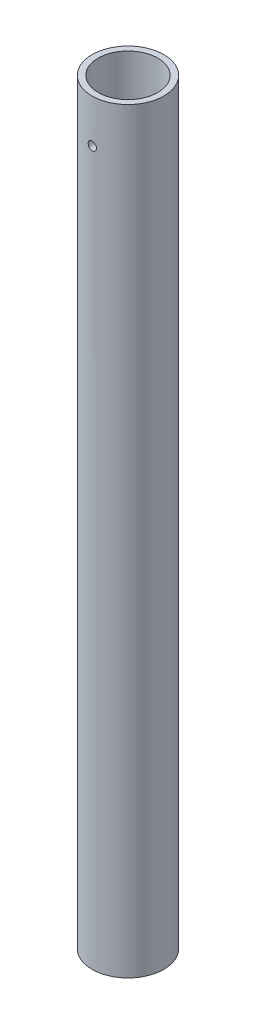
ISO-10303-21;
HEADER;
FILE_DESCRIPTION(('STEP AP214'),'2;1');
FILE_NAME('part.step','',(''),(''),'','','');
FILE_SCHEMA(('AUTOMOTIVE_DESIGN { 1 0 10303 214 1 1 1 1 }'));
ENDSEC;
DATA;
#1=APPLICATION_CONTEXT('core data for automotive mechanical design processes');
#2=APPLICATION_PROTOCOL_DEFINITION('international standard','automotive_design',2000,#1);
#3=PRODUCT_CONTEXT('',#1,'mechanical');
#4=PRODUCT('Part','Part','',(#3));
#5=PRODUCT_RELATED_PRODUCT_CATEGORY('part','',(#4));
#6=PRODUCT_DEFINITION_FORMATION('','',#4);
#7=PRODUCT_DEFINITION_CONTEXT('part definition',#1,'design');
#8=PRODUCT_DEFINITION('design','',#6,#7);
#9=PRODUCT_DEFINITION_SHAPE('','',#8);
#10=(LENGTH_UNIT() NAMED_UNIT(*) SI_UNIT(.MILLI.,.METRE.));
#11=(NAMED_UNIT(*) PLANE_ANGLE_UNIT() SI_UNIT($,.RADIAN.));
#12=(NAMED_UNIT(*) SI_UNIT($,.STERADIAN.) SOLID_ANGLE_UNIT());
#13=UNCERTAINTY_MEASURE_WITH_UNIT(LENGTH_MEASURE(1.E-05),#10,'distance_accuracy_value','');
#14=(GEOMETRIC_REPRESENTATION_CONTEXT(3) GLOBAL_UNCERTAINTY_ASSIGNED_CONTEXT((#13)) GLOBAL_UNIT_ASSIGNED_CONTEXT((#10,
#11,#12)) REPRESENTATION_CONTEXT('',''));
#15=CARTESIAN_POINT('',(0.,0.,0.));
#16=DIRECTION('',(0.,0.,1.));
#17=DIRECTION('',(1.,0.,0.));
#18=AXIS2_PLACEMENT_3D('',#15,#16,#17);
#19=CARTESIAN_POINT('',(0.,444.5,0.));
#20=DIRECTION('',(0.,1.,0.));
#21=DIRECTION('',(0.,0.,1.));
#22=AXIS2_PLACEMENT_3D('',#19,#20,#21);
#23=PLANE('',#22);
#24=CARTESIAN_POINT('',(0.,444.5,0.));
#25=DIRECTION('',(0.,1.,0.));
#26=DIRECTION('',(0.,0.,1.));
#27=AXIS2_PLACEMENT_3D('',#24,#25,#26);
#28=CIRCLE('',#27,21.082);
#29=CARTESIAN_POINT('',(0.,444.5,21.082));
#30=VERTEX_POINT('',#29);
#31=EDGE_CURVE('E46',#30,#30,#28,.T.);
#32=ORIENTED_EDGE('',*,*,#31,.T.);
#33=EDGE_LOOP('',(#32));
#34=FACE_BOUND('',#33,.T.);
#35=CARTESIAN_POINT('',(0.,444.5,0.));
#36=DIRECTION('',(0.,1.,0.));
#37=DIRECTION('',(0.,0.,1.));
#38=AXIS2_PLACEMENT_3D('',#35,#36,#37);
#39=CIRCLE('',#38,17.526);
#40=CARTESIAN_POINT('',(0.,444.5,17.526));
#41=VERTEX_POINT('',#40);
#42=EDGE_CURVE('E82',#41,#41,#39,.T.);
#43=ORIENTED_EDGE('',*,*,#42,.F.);
#44=EDGE_LOOP('',(#43));
#45=FACE_BOUND('',#44,.T.);
#46=ADVANCED_FACE('F30',(#34,#45),#23,.T.);
#47=CARTESIAN_POINT('',(0.,0.,0.));
#48=DIRECTION('',(0.,1.,0.));
#49=DIRECTION('',(0.,0.,1.));
#50=AXIS2_PLACEMENT_3D('',#47,#48,#49);
#51=PLANE('',#50);
#52=CARTESIAN_POINT('',(0.,0.,0.));
#53=DIRECTION('',(0.,1.,0.));
#54=DIRECTION('',(0.,0.,1.));
#55=AXIS2_PLACEMENT_3D('',#52,#53,#54);
#56=CIRCLE('',#55,21.082);
#57=CARTESIAN_POINT('',(0.,0.,21.082));
#58=VERTEX_POINT('',#57);
#59=EDGE_CURVE('E50',#58,#58,#56,.T.);
#60=ORIENTED_EDGE('',*,*,#59,.F.);
#61=EDGE_LOOP('',(#60));
#62=FACE_BOUND('',#61,.T.);
#63=CARTESIAN_POINT('',(0.,0.,0.));
#64=DIRECTION('',(0.,1.,0.));
#65=DIRECTION('',(0.,0.,1.));
#66=AXIS2_PLACEMENT_3D('',#63,#64,#65);
#67=CIRCLE('',#66,17.526);
#68=CARTESIAN_POINT('',(0.,0.,17.526));
#69=VERTEX_POINT('',#68);
#70=EDGE_CURVE('E81',#69,#69,#67,.T.);
#71=ORIENTED_EDGE('',*,*,#70,.T.);
#72=EDGE_LOOP('',(#71));
#73=FACE_BOUND('',#72,.T.);
#74=ADVANCED_FACE('F88',(#62,#73),#51,.F.);
#75=CARTESIAN_POINT('',(0.,444.5,0.));
#76=DIRECTION('',(0.,-1.,0.));
#77=DIRECTION('',(0.,0.,-1.));
#78=AXIS2_PLACEMENT_3D('',#75,#76,#77);
#79=CYLINDRICAL_SURFACE('',#78,21.082);
#80=CARTESIAN_POINT('',(0.,421.55745,-21.082));
#81=CARTESIAN_POINT('',(-0.137535587151131,421.557444113368,-21.0819981896699));
#82=CARTESIAN_POINT('',(-0.275158927091594,421.545864951829,-21.0806398639898));
#83=CARTESIAN_POINT('',(-0.546581132900881,421.499853296938,-21.0753518736465));
#84=CARTESIAN_POINT('',(-0.680375767190936,421.465396464516,-21.0714194705398));
#85=CARTESIAN_POINT('',(-0.940171479974304,421.374654035912,-21.0614266548056));
#86=CARTESIAN_POINT('',(-1.06617754902381,421.318382589229,-21.0553676218034));
#87=CARTESIAN_POINT('',(-1.30693195036864,421.185638009358,-21.0417967399056));
#88=CARTESIAN_POINT('',(-1.42168231936252,421.109168540248,-21.0342851545803));
#89=CARTESIAN_POINT('',(-1.63724593362093,420.9378043335,-21.0186083763947));
#90=CARTESIAN_POINT('',(-1.73799719996763,420.842831867385,-21.0104405147708));
#91=CARTESIAN_POINT('',(-1.92216922319142,420.637324190622,-20.9943934662811));
#92=CARTESIAN_POINT('',(-2.00558912743435,420.526788214758,-20.9865142936334));
#93=CARTESIAN_POINT('',(-2.15295760424346,420.292893301085,-20.9719101911828));
#94=CARTESIAN_POINT('',(-2.21684876356064,420.169497956862,-20.9651886896703));
#95=CARTESIAN_POINT('',(-2.32297949702382,419.913638090933,-20.9536955439046));
#96=CARTESIAN_POINT('',(-2.36521978780042,419.781173869567,-20.9489238351154));
#97=CARTESIAN_POINT('',(-2.42666289043975,419.511576242373,-20.9418956403549));
#98=CARTESIAN_POINT('',(-2.44596977868253,419.374466857479,-20.939627794685));
#99=CARTESIAN_POINT('',(-2.46131995575617,419.098936639866,-20.9378291899759));
#100=CARTESIAN_POINT('',(-2.45736406240552,418.960515853421,-20.9382983347161));
#101=CARTESIAN_POINT('',(-2.42638652517884,418.687014543881,-20.9419103117644));
#102=CARTESIAN_POINT('',(-2.39947915811836,418.551920877759,-20.9450398973115));
#103=CARTESIAN_POINT('',(-2.32354059857019,418.28817971862,-20.9535994649235));
#104=CARTESIAN_POINT('',(-2.27450901149825,418.159532340617,-20.9590294880166));
#105=CARTESIAN_POINT('',(-2.15558981480335,417.911978403679,-20.9715932157184));
#106=CARTESIAN_POINT('',(-2.08565216967469,417.793096096093,-20.9787309993207));
#107=CARTESIAN_POINT('',(-1.92694197861827,417.568712541223,-20.9939027542921));
#108=CARTESIAN_POINT('',(-1.83816868318267,417.463211826685,-21.0019367613176));
#109=CARTESIAN_POINT('',(-1.64367202552417,417.267922658712,-21.0180546873897));
#110=CARTESIAN_POINT('',(-1.53785009251606,417.178232347655,-21.0261386164902));
#111=CARTESIAN_POINT('',(-1.31260048572373,417.017872859645,-21.0414002645652));
#112=CARTESIAN_POINT('',(-1.19317278712314,416.947203717388,-21.0485779818868));
#113=CARTESIAN_POINT('',(-0.944028858451737,416.826893986244,-21.0612221258942));
#114=CARTESIAN_POINT('',(-0.814309839696777,416.777259120374,-21.0666880867391));
#115=CARTESIAN_POINT('',(-0.548300869606873,416.700502632244,-21.0752884694049));
#116=CARTESIAN_POINT('',(-0.412011185822732,416.673380094124,-21.0784229860746));
#117=CARTESIAN_POINT('',(-0.137578711733366,416.642544394849,-21.0819950339558));
#118=CARTESIAN_POINT('',(0.000548683627768363,416.638695954107,-21.0824481503478));
#119=CARTESIAN_POINT('',(0.275480478767385,416.654161301736,-21.0806483192139));
#120=CARTESIAN_POINT('',(0.412284902925733,416.673474662456,-21.0783954216509));
#121=CARTESIAN_POINT('',(0.680291365438066,416.734603045445,-21.0714464899951));
#122=CARTESIAN_POINT('',(0.811508216052581,416.776353984287,-21.0667574150722));
#123=CARTESIAN_POINT('',(1.0650770901543,416.881106021545,-21.0554614675241));
#124=CARTESIAN_POINT('',(1.18742884870696,416.944107754729,-21.0488545376131));
#125=CARTESIAN_POINT('',(1.4204013056391,417.08990325352,-21.034421455777));
#126=CARTESIAN_POINT('',(1.53096659172733,417.17278502454,-21.02658993805));
#127=CARTESIAN_POINT('',(1.73666482657244,417.355862782572,-21.0106017013241));
#128=CARTESIAN_POINT('',(1.83179724493868,417.456059364409,-21.0024449711605));
#129=CARTESIAN_POINT('',(2.00440555916567,417.67151642908,-20.9866779589737));
#130=CARTESIAN_POINT('',(2.08179209774767,417.786848740498,-20.9790705691357));
#131=CARTESIAN_POINT('',(2.2160957214879,418.02895279811,-20.9653099402238));
#132=CARTESIAN_POINT('',(2.27301317109504,418.155724340582,-20.9591566752602));
#133=CARTESIAN_POINT('',(2.36461647986381,418.416813421065,-20.9490201779776));
#134=CARTESIAN_POINT('',(2.39935372442175,418.551112727645,-20.9450319331443));
#135=CARTESIAN_POINT('',(2.44577651593614,418.823687318341,-20.939662275977));
#136=CARTESIAN_POINT('',(2.45746298492459,418.961962443198,-20.9382807593737));
#137=CARTESIAN_POINT('',(2.45743707086335,419.237674916166,-20.9382837303195));
#138=CARTESIAN_POINT('',(2.44586505842128,419.375112298926,-20.9396516245056));
#139=CARTESIAN_POINT('',(2.39994685914769,419.646075176349,-20.9449637239784));
#140=CARTESIAN_POINT('',(2.36560066054765,419.779600668992,-20.9489079305964));
#141=CARTESIAN_POINT('',(2.27515112943171,420.038937200367,-20.9589233045321));
#142=CARTESIAN_POINT('',(2.21905362298967,420.16475029442,-20.9649939022554));
#143=CARTESIAN_POINT('',(2.08670781464672,420.405199167527,-20.9785790794334));
#144=CARTESIAN_POINT('',(2.01045939117852,420.519834879144,-20.9860936675996));
#145=CARTESIAN_POINT('',(1.83945267760811,420.735393379043,-21.0017744977369));
#146=CARTESIAN_POINT('',(1.74458969157364,420.836232858205,-21.0099442634251));
#147=CARTESIAN_POINT('',(1.53926241176638,421.020617887081,-21.0259833622734));
#148=CARTESIAN_POINT('',(1.42879442529097,421.104159331889,-21.0338526237619));
#149=CARTESIAN_POINT('',(1.19497695132098,421.251808188221,-21.0484324834556));
#150=CARTESIAN_POINT('',(1.071585838109,421.31585003162,-21.0551391405086));
#151=CARTESIAN_POINT('',(0.815795089691321,421.422215119035,-21.0665974023545));
#152=CARTESIAN_POINT('',(0.683405560176054,421.464562285325,-21.0713511594187));
#153=CARTESIAN_POINT('',(0.458589087915364,421.516045407948,-21.0772043875154));
#154=CARTESIAN_POINT('',(0.367587332394301,421.531550218081,-21.0789941178971));
#155=CARTESIAN_POINT('',(0.184403531226218,421.552254456195,-21.0813925274694));
#156=CARTESIAN_POINT('',(0.0922214927954303,421.557453947153,-21.0820012138774));
#157=CARTESIAN_POINT('',(0.,421.55745,-21.082));
#158=B_SPLINE_CURVE_WITH_KNOTS('',3,(#80,#81,#82,#83,#84,#85,#86,#87,#88,#89,#90,#91,#92,#93,
#94,#95,#96,#97,#98,#99,#100,#101,#102,#103,#104,#105,#106,#107,#108,#109,#110,#111,#112,#113,
#114,#115,#116,#117,#118,#119,#120,#121,#122,#123,#124,#125,#126,#127,#128,#129,#130,#131,#132,
#133,#134,#135,#136,#137,#138,#139,#140,#141,#142,#143,#144,#145,#146,#147,#148,#149,#150,#151,
#152,#153,#154,#155,#156,#157),.UNSPECIFIED.,.T.,.F.,(4,2,2,2,2,2,2,2,2,2,2,2,2,2,2,2,2,2,2,2,2,
2,2,2,2,2,2,2,2,2,2,2,2,2,2,2,2,2,4),(0.,0.412269941606786,0.824979192800623,1.2374211972582,
1.64978843287184,2.06392684568487,2.47808562764058,2.89345055103036,3.3088017252055,
3.72226066186234,4.13570506318367,4.54710283560512,4.95850794557352,5.37090568455282,
5.78331983673371,6.19821019320759,6.61310130643719,7.02810523106394,7.44309227140162,
7.85566488287456,8.26822987686833,8.67962276777935,9.09102794815922,9.50428909680527,
9.91756444523797,10.3328772064413,10.7481825727001,11.162522266582,11.5768453865226,
11.9886754741001,12.4005057744902,12.8122258425141,13.2239483944364,13.6380566877443,
14.0522631385876,14.4678473721359,14.8829723577924,15.1594126783116,15.4358513094848),.UNSPECIFIED.);
#159=CARTESIAN_POINT('',(0.,421.55745,-21.082));
#160=VERTEX_POINT('',#159);
#161=EDGE_CURVE('E10',#160,#160,#158,.T.);
#162=ORIENTED_EDGE('',*,*,#161,.T.);
#163=EDGE_LOOP('',(#162));
#164=FACE_BOUND('',#163,.T.);
#165=CARTESIAN_POINT('',(2.45744999999999,419.1,20.938282248014));
#166=CARTESIAN_POINT('',(2.45744411019976,418.962467991744,20.9382841045217));
#167=CARTESIAN_POINT('',(2.44586553091841,418.824848219917,20.9396519261716));
#168=CARTESIAN_POINT('',(2.39985639892885,418.553433427284,20.9449738323792));
#169=CARTESIAN_POINT('',(2.3654014946212,418.41964264087,20.9489306728541));
#170=CARTESIAN_POINT('',(2.27466470588172,418.159855066042,20.9589764768841));
#171=CARTESIAN_POINT('',(2.21839706247109,418.033853254495,20.9650640490835));
#172=CARTESIAN_POINT('',(2.08566144022914,417.793105992693,20.9786837140271));
#173=CARTESIAN_POINT('',(2.00919711619984,417.678358510996,20.9862155453498));
#174=CARTESIAN_POINT('',(1.83783811680315,417.462791660352,21.001916300071));
#175=CARTESIAN_POINT('',(1.74286456256089,417.362035179194,21.0100878572451));
#176=CARTESIAN_POINT('',(1.53735251675632,417.177853084444,21.0261235791516));
#177=CARTESIAN_POINT('',(1.42681327424547,417.094428307482,21.0339877290301));
#178=CARTESIAN_POINT('',(1.19291547467592,416.947054716335,21.0485492343405));
#179=CARTESIAN_POINT('',(1.06952107309786,416.883162425696,21.0552431799176));
#180=CARTESIAN_POINT('',(0.813663255252889,416.777029340958,21.0666811919646));
#181=CARTESIAN_POINT('',(0.681200133774674,416.734787843455,21.0714253217802));
#182=CARTESIAN_POINT('',(0.411605970582518,416.673342247197,21.0784106361542));
#183=CARTESIAN_POINT('',(0.274498973953218,416.654033957046,21.0806631375814));
#184=CARTESIAN_POINT('',(-0.00102656033661871,416.638680148584,21.0824499927296));
#185=CARTESIAN_POINT('',(-0.139445052591957,416.642633827839,21.0819844402113));
#186=CARTESIAN_POINT('',(-0.412956075940708,416.673607840783,21.0783968360856));
#187=CARTESIAN_POINT('',(-0.54806148895545,416.700516127111,21.0752876887885));
#188=CARTESIAN_POINT('',(-0.811825666546076,416.776460589616,21.0667768421163));
#189=CARTESIAN_POINT('',(-0.940484322227975,416.825497139428,21.061375104031));
#190=CARTESIAN_POINT('',(-1.18805200322681,416.944426650325,21.0488639035827));
#191=CARTESIAN_POINT('',(-1.30693733498425,417.014368495409,21.0417504462974));
#192=CARTESIAN_POINT('',(-1.53132516076252,417.173087671141,21.0266125122783));
#193=CARTESIAN_POINT('',(-1.63682712063344,417.261865753193,21.018587999207));
#194=CARTESIAN_POINT('',(-1.83211095243769,417.456365829534,21.0024705933476));
#195=CARTESIAN_POINT('',(-1.92179564636022,417.562185411451,20.9943775776419));
#196=CARTESIAN_POINT('',(-2.08214491787265,417.787428304536,20.9790825605783));
#197=CARTESIAN_POINT('',(-2.15280944897754,417.90685164895,20.971880561398));
#198=CARTESIAN_POINT('',(-2.27311585362875,418.155994349294,20.9591828788349));
#199=CARTESIAN_POINT('',(-2.32275058881054,418.285717183575,20.95368777501));
#200=CARTESIAN_POINT('',(-2.39950564856285,418.551734454443,20.9450376478535));
#201=CARTESIAN_POINT('',(-2.42662691244395,418.688028616608,20.9418825268933));
#202=CARTESIAN_POINT('',(-2.45745779983285,418.962463250902,20.9382871537641));
#203=CARTESIAN_POINT('',(-2.4613038898973,419.100588192685,20.9378310769598));
#204=CARTESIAN_POINT('',(-2.44583471659237,419.375514517768,20.9396436168987));
#205=CARTESIAN_POINT('',(-2.42651988109657,419.51231592547,20.941912183307));
#206=CARTESIAN_POINT('',(-2.36539177561415,419.780306990534,20.9489039790577));
#207=CARTESIAN_POINT('',(-2.32364402259562,419.911511794711,20.9536200588945));
#208=CARTESIAN_POINT('',(-2.21890238639398,420.165057983439,20.9649697091935));
#209=CARTESIAN_POINT('',(-2.15590784956895,420.287399095165,20.9716033386469));
#210=CARTESIAN_POINT('',(-2.01012301336265,420.520364172145,20.9860787085831));
#211=CARTESIAN_POINT('',(-1.9272428820915,420.630931580045,20.9939258722377));
#212=CARTESIAN_POINT('',(-1.7441671439661,420.836634858552,21.0099268609532));
#213=CARTESIAN_POINT('',(-1.64397095282544,420.931770208234,21.0180806963546));
#214=CARTESIAN_POINT('',(-1.42851263514935,421.10438503644,21.0338246191306));
#215=CARTESIAN_POINT('',(-1.31317860531375,421.181775075393,21.0414117261437));
#216=CARTESIAN_POINT('',(-1.07107016031842,421.316084837822,21.0551232123828));
#217=CARTESIAN_POINT('',(-0.944295949714627,421.373004927218,21.0612476177554));
#218=CARTESIAN_POINT('',(-0.683208408027676,421.464609943258,21.0713303443191));
#219=CARTESIAN_POINT('',(-0.548913712945645,421.499347399176,21.0752937794842));
#220=CARTESIAN_POINT('',(-0.276348862556842,421.545772175366,21.0806291458089));
#221=CARTESIAN_POINT('',(-0.138078862209206,421.557460392874,21.0820011778439));
#222=CARTESIAN_POINT('',(0.137636471442634,421.557439654299,21.0819988274558));
#223=CARTESIAN_POINT('',(0.275081835934557,421.545868942141,21.0806406724236));
#224=CARTESIAN_POINT('',(0.54606100574566,421.499950538974,21.0753627011691));
#225=CARTESIAN_POINT('',(0.67959481144678,421.465602850189,21.0714428851968));
#226=CARTESIAN_POINT('',(0.938948275029067,421.375147120229,21.0614802779372));
#227=CARTESIAN_POINT('',(1.06476994756528,421.319044790359,21.055438043893));
#228=CARTESIAN_POINT('',(1.30523397020143,421.186686673607,21.0419012715349));
#229=CARTESIAN_POINT('',(1.41987625819521,421.110430774773,21.0344067251536));
#230=CARTESIAN_POINT('',(1.63543458664256,420.939415750508,21.0187497824404));
#231=CARTESIAN_POINT('',(1.73626867166934,420.844553644694,21.010583823207));
#232=CARTESIAN_POINT('',(1.92064322782071,420.639230356925,20.9945336194599));
#233=CARTESIAN_POINT('',(2.00417957978508,420.528765469945,20.9866494424169));
#234=CARTESIAN_POINT('',(2.15182285129793,420.294950609237,20.9720271331898));
#235=CARTESIAN_POINT('',(2.21586331473452,420.171558448961,20.9652929545289));
#236=CARTESIAN_POINT('',(2.32222553364892,419.91576549846,20.9537796223097));
#237=CARTESIAN_POINT('',(2.36457122881468,419.783374821484,20.9489983149888));
#238=CARTESIAN_POINT('',(2.41605027829372,419.558562270667,20.9431093678139));
#239=CARTESIAN_POINT('',(2.43155325507291,419.467565871026,20.9413080464585));
#240=CARTESIAN_POINT('',(2.45225505823439,419.284392794884,20.9388938678798));
#241=CARTESIAN_POINT('',(2.4574539491502,419.192216125779,20.9382810032133));
#242=CARTESIAN_POINT('',(2.45744999999999,419.1,20.938282248014));
#243=B_SPLINE_CURVE_WITH_KNOTS('',3,(#165,#166,#167,#168,#169,#170,#171,#172,#173,#174,#175,
#176,#177,#178,#179,#180,#181,#182,#183,#184,#185,#186,#187,#188,#189,#190,#191,#192,#193,#194,
#195,#196,#197,#198,#199,#200,#201,#202,#203,#204,#205,#206,#207,#208,#209,#210,#211,#212,#213,
#214,#215,#216,#217,#218,#219,#220,#221,#222,#223,#224,#225,#226,#227,#228,#229,#230,#231,#232,
#233,#234,#235,#236,#237,#238,#239,#240,#241,#242),.UNSPECIFIED.,.T.,.F.,(4,2,2,2,2,2,2,2,2,2,2,
2,2,2,2,2,2,2,2,2,2,2,2,2,2,2,2,2,2,2,2,2,2,2,2,2,2,2,4),(0.,0.412259190530644,0.82495793158785,
1.23738768395275,1.64974285388279,2.06389533753673,2.47806780834554,2.89342771647981,
3.30877412928883,3.72222621022229,4.13566402898656,4.54709522337294,4.95853336501787,
5.37094122361878,5.78336553684365,6.19824155054138,6.61311857818104,7.02813631928382,
7.4431367440809,7.85570157028065,8.2682587748997,8.67961757350445,9.09098902841904,
9.50425502586612,9.91753497064729,10.3328542496639,10.7481661040428,11.1624908018752,
11.5767993709889,11.9886526987889,12.4005059863738,12.8122512221382,13.2239987451892,
13.6380929850238,14.0522857212252,14.4678749128306,14.8830045179998,15.1594287769651,
15.4358513047063),.UNSPECIFIED.);
#244=CARTESIAN_POINT('',(2.45744999999999,419.1,20.938282248014));
#245=VERTEX_POINT('',#244);
#246=EDGE_CURVE('E42',#245,#245,#243,.T.);
#247=ORIENTED_EDGE('',*,*,#246,.T.);
#248=EDGE_LOOP('',(#247));
#249=FACE_BOUND('',#248,.T.);
#250=ORIENTED_EDGE('',*,*,#31,.F.);
#251=EDGE_LOOP('',(#250));
#252=FACE_BOUND('',#251,.T.);
#253=ORIENTED_EDGE('',*,*,#59,.T.);
#254=EDGE_LOOP('',(#253));
#255=FACE_BOUND('',#254,.T.);
#256=ADVANCED_FACE('F32',(#164,#249,#252,#255),#79,.T.);
#257=CARTESIAN_POINT('',(0.,444.5,0.));
#258=DIRECTION('',(0.,-1.,0.));
#259=DIRECTION('',(0.,0.,-1.));
#260=AXIS2_PLACEMENT_3D('',#257,#258,#259);
#261=CYLINDRICAL_SURFACE('',#260,17.526);
#262=CARTESIAN_POINT('',(0.,421.55745,-17.526));
#263=CARTESIAN_POINT('',(-0.137313584698908,421.557444262247,-17.5259979035798));
#264=CARTESIAN_POINT('',(-0.27470938098926,421.545902271459,-17.5243692864859));
#265=CARTESIAN_POINT('',(-0.545667633177901,421.500046925665,-17.5180291139445));
#266=CARTESIAN_POINT('',(-0.679226104788644,421.465710735807,-17.5133144670295));
#267=CARTESIAN_POINT('',(-0.938548610824709,421.375307148024,-17.5013325963351));
#268=CARTESIAN_POINT('',(-1.06431819611889,421.319255437609,-17.4940672155858));
#269=CARTESIAN_POINT('',(-1.30464510431335,421.187048649461,-17.4777888529064));
#270=CARTESIAN_POINT('',(-1.41920413091019,421.110896632945,-17.4687761371458));
#271=CARTESIAN_POINT('',(-1.63466536201846,420.94009334655,-17.4499378396296));
#272=CARTESIAN_POINT('',(-1.73547949463124,420.845331478553,-17.4401076113061));
#273=CARTESIAN_POINT('',(-1.91982986195647,420.640236283307,-17.4207790315578));
#274=CARTESIAN_POINT('',(-2.00336515134966,420.529902104658,-17.4112806983145));
#275=CARTESIAN_POINT('',(-2.15112359612906,420.296210152974,-17.3936460725588));
#276=CARTESIAN_POINT('',(-2.21526260813035,420.172798685905,-17.3855157804919));
#277=CARTESIAN_POINT('',(-2.32187026625514,419.916822252377,-17.3716004592687));
#278=CARTESIAN_POINT('',(-2.36433994384769,419.78425772195,-17.365815318485));
#279=CARTESIAN_POINT('',(-2.42613216297919,419.51465985157,-17.3572905463897));
#280=CARTESIAN_POINT('',(-2.44560470188293,419.377661526178,-17.35453118815));
#281=CARTESIAN_POINT('',(-2.4613143500358,419.102316023101,-17.3523103486831));
#282=CARTESIAN_POINT('',(-2.45755262774418,418.963968913594,-17.3528487016127));
#283=CARTESIAN_POINT('',(-2.42702333872359,418.690906695555,-17.3571444091685));
#284=CARTESIAN_POINT('',(-2.40042207065975,418.556172575762,-17.3608784944864));
#285=CARTESIAN_POINT('',(-2.32522877274596,418.293099429306,-17.3711086086991));
#286=CARTESIAN_POINT('',(-2.27663619307288,418.164760562625,-17.3776047066491));
#287=CARTESIAN_POINT('',(-2.1586643003694,417.917610628605,-17.3926528916365));
#288=CARTESIAN_POINT('',(-2.08921379664038,417.798833987651,-17.4012119999095));
#289=CARTESIAN_POINT('',(-1.9315482916025,417.574557755089,-17.4194166021337));
#290=CARTESIAN_POINT('',(-1.8433322122598,417.469058926811,-17.4290621584836));
#291=CARTESIAN_POINT('',(-1.64972321655835,417.273368631844,-17.4484559312095));
#292=CARTESIAN_POINT('',(-1.54418716980878,417.183318728914,-17.4582043091126));
#293=CARTESIAN_POINT('',(-1.31942389369255,417.022188351203,-17.4766269583257));
#294=CARTESIAN_POINT('',(-1.20019661724472,416.951107941656,-17.4853012259417));
#295=CARTESIAN_POINT('',(-0.951318187232436,416.829929956328,-17.5006057657572));
#296=CARTESIAN_POINT('',(-0.821662065406591,416.7798424529,-17.5072350563791));
#297=CARTESIAN_POINT('',(-0.555665446583849,416.702190724937,-17.5176942501772));
#298=CARTESIAN_POINT('',(-0.419325344493195,416.674625171445,-17.5215243185263));
#299=CARTESIAN_POINT('',(-0.145053668180893,416.642986102272,-17.5259318188799));
#300=CARTESIAN_POINT('',(-0.00714498008643752,416.638717806524,-17.5265362186008));
#301=CARTESIAN_POINT('',(0.267420012463917,416.653278636268,-17.5244974452953));
#302=CARTESIAN_POINT('',(0.404076350570329,416.672107139308,-17.5218543597877));
#303=CARTESIAN_POINT('',(0.671673768066695,416.732165177893,-17.5136343037714));
#304=CARTESIAN_POINT('',(0.802636369403389,416.77330065006,-17.5080696559355));
#305=CARTESIAN_POINT('',(1.05580531527905,416.87670632634,-17.494628790179));
#306=CARTESIAN_POINT('',(1.17801129412724,416.938977412487,-17.4867524757895));
#307=CARTESIAN_POINT('',(1.41106006458368,417.083349517641,-17.4694975275255));
#308=CARTESIAN_POINT('',(1.52182498726753,417.165575102169,-17.4601095863565));
#309=CARTESIAN_POINT('',(1.72805234000045,417.347347550135,-17.4409076104019));
#310=CARTESIAN_POINT('',(1.82351399776281,417.446895287215,-17.431093554144));
#311=CARTESIAN_POINT('',(1.99712650568201,417.661349691057,-17.4120608789176));
#312=CARTESIAN_POINT('',(2.07514737326774,417.77636207662,-17.4028470714761));
#313=CARTESIAN_POINT('',(2.21076236927752,418.017973838594,-17.3861408657778));
#314=CARTESIAN_POINT('',(2.26835699313538,418.144572933877,-17.3786484257713));
#315=CARTESIAN_POINT('',(2.36127941508932,418.405363752403,-17.3662673267763));
#316=CARTESIAN_POINT('',(2.39667762308563,418.539529980373,-17.361370442077));
#317=CARTESIAN_POINT('',(2.44442764786375,418.811976197678,-17.35471234094));
#318=CARTESIAN_POINT('',(2.45678083937194,418.950255941126,-17.3529509374588));
#319=CARTESIAN_POINT('',(2.45806054060965,419.225709448809,-17.3527696031539));
#320=CARTESIAN_POINT('',(2.44719134212328,419.362882288918,-17.3543205330566));
#321=CARTESIAN_POINT('',(2.40277045238328,419.633429585809,-17.3605260693105));
#322=CARTESIAN_POINT('',(2.36921878010967,419.766804045767,-17.3651806730646));
#323=CARTESIAN_POINT('',(2.28045421447676,420.025924134982,-17.3770593966486));
#324=CARTESIAN_POINT('',(2.22525378837799,420.151674107052,-17.3842820373532));
#325=CARTESIAN_POINT('',(2.09477878698055,420.392160477115,-17.400485067998));
#326=CARTESIAN_POINT('',(2.01950370652988,420.506896597861,-17.409465502169));
#327=CARTESIAN_POINT('',(1.85026722412437,420.723139091537,-17.4282665869345));
#328=CARTESIAN_POINT('',(1.75615406109153,420.82452614537,-17.4380936659362));
#329=CARTESIAN_POINT('',(1.55223289572369,421.010142719056,-17.4574258134156));
#330=CARTESIAN_POINT('',(1.44242123133023,421.09436822441,-17.4669308061169));
#331=CARTESIAN_POINT('',(1.20960726248238,421.243624932687,-17.4845991900352));
#332=CARTESIAN_POINT('',(1.08654436529854,421.30856237925,-17.4927559452655));
#333=CARTESIAN_POINT('',(0.831207201776094,421.416752085084,-17.5067430950473));
#334=CARTESIAN_POINT('',(0.698942839466505,421.460027261568,-17.5125759467915));
#335=CARTESIAN_POINT('',(0.471705182020437,421.513621684123,-17.519895641402));
#336=CARTESIAN_POINT('',(0.378147818276043,421.530032810765,-17.522173271037));
#337=CARTESIAN_POINT('',(0.189740047370781,421.551948895679,-17.5252261670435));
#338=CARTESIAN_POINT('',(0.0948896533902688,421.557453965037,-17.5260014487175));
#339=CARTESIAN_POINT('',(0.,421.55745,-17.526));
#340=B_SPLINE_CURVE_WITH_KNOTS('',3,(#262,#263,#264,#265,#266,#267,#268,#269,#270,#271,#272,
#273,#274,#275,#276,#277,#278,#279,#280,#281,#282,#283,#284,#285,#286,#287,#288,#289,#290,#291,
#292,#293,#294,#295,#296,#297,#298,#299,#300,#301,#302,#303,#304,#305,#306,#307,#308,#309,#310,
#311,#312,#313,#314,#315,#316,#317,#318,#319,#320,#321,#322,#323,#324,#325,#326,#327,#328,#329,
#330,#331,#332,#333,#334,#335,#336,#337,#338,#339),.UNSPECIFIED.,.T.,.F.,(4,2,2,2,2,2,2,2,2,2,2,
2,2,2,2,2,2,2,2,2,2,2,2,2,2,2,2,2,2,2,2,2,2,2,2,2,2,2,4),(0.,0.411594074113728,
0.823601099863353,1.23531104097031,1.64695831600511,2.06113037740559,2.4753250920198,
2.89129167521462,3.3072384563845,3.7204569990632,4.13365476100366,4.54386922837034,
4.95409395241793,5.3657350518115,5.77739980531222,6.19265575442001,6.60791313154563,
7.02336952086857,7.43880139350359,7.8507546065506,8.26269671781038,8.67291511996532,
9.08315064353472,9.49601608401862,9.90890235340313,10.3247701537904,10.7406278667107,
11.1551596616745,11.5696667273861,11.9805423182014,12.3914175652087,12.8020565406703,
13.2127058502912,13.626807145415,14.0410051978756,14.4571848396401,14.8729232561056,
15.1573555425078,15.4417849317468),.UNSPECIFIED.);
#341=CARTESIAN_POINT('',(0.,421.55745,-17.526));
#342=VERTEX_POINT('',#341);
#343=EDGE_CURVE('E75',#342,#342,#340,.T.);
#344=ORIENTED_EDGE('',*,*,#343,.F.);
#345=EDGE_LOOP('',(#344));
#346=FACE_BOUND('',#345,.T.);
#347=CARTESIAN_POINT('',(2.45744999999999,419.1,17.3528561193107));
#348=CARTESIAN_POINT('',(2.45744425576783,418.962693895738,17.3528582939304));
#349=CARTESIAN_POINT('',(2.44590348004676,418.825305559006,17.3545034086685));
#350=CARTESIAN_POINT('',(2.4000533987206,418.554362803301,17.3609024781592));
#351=CARTESIAN_POINT('',(2.36572123153113,418.420812374532,17.3656595543875));
#352=CARTESIAN_POINT('',(2.27532940885058,418.161506883719,17.3777333854527));
#353=CARTESIAN_POINT('',(2.21928563131458,418.035746202718,17.385048269355));
#354=CARTESIAN_POINT('',(2.08709753079152,417.795434245218,17.4014112813078));
#355=CARTESIAN_POINT('',(2.01095624988985,417.680881275843,17.4104591469864));
#356=CARTESIAN_POINT('',(1.84016386164744,417.465413332606,17.4293396169183));
#357=CARTESIAN_POINT('',(1.74539975298671,417.364588319185,17.4391767834153));
#358=CARTESIAN_POINT('',(1.54029549082823,417.180216915157,17.4584866165296));
#359=CARTESIAN_POINT('',(1.42995451580122,417.096671436451,17.4679592638884));
#360=CARTESIAN_POINT('',(1.19625648272949,416.948902235041,17.4855201030188));
#361=CARTESIAN_POINT('',(1.07284689996686,416.884760812199,17.4936023367597));
#362=CARTESIAN_POINT('',(0.816874557612644,416.778148178908,17.507421317107));
#363=CARTESIAN_POINT('',(0.684312222359978,416.7356759646,17.5131581723643));
#364=CARTESIAN_POINT('',(0.414721589694941,416.673878594524,17.5216078406156));
#365=CARTESIAN_POINT('',(0.277728363103461,416.654403168929,17.5243402774558));
#366=CARTESIAN_POINT('',(0.00239288164662871,416.638685980198,17.526540397484));
#367=CARTESIAN_POINT('',(-0.135949306924399,416.642443080995,17.5260082403102));
#368=CARTESIAN_POINT('',(-0.409031630685059,416.672964950569,17.5217548920635));
#369=CARTESIAN_POINT('',(-0.543790230666945,416.69956807682,17.5180561064079));
#370=CARTESIAN_POINT('',(-0.806911374062278,416.77477353677,17.507910106928));
#371=CARTESIAN_POINT('',(-0.935273770024519,416.823376377365,17.5014628297757));
#372=CARTESIAN_POINT('',(-1.18245262327643,416.941369723796,17.4865056623644));
#373=CARTESIAN_POINT('',(-1.30123579433163,417.010829060881,17.4779889605619));
#374=CARTESIAN_POINT('',(-1.5255213616307,417.168513531246,17.4598436566784));
#375=CARTESIAN_POINT('',(-1.63102299211325,417.256739745763,17.4502149905473));
#376=CARTESIAN_POINT('',(-1.82670222399159,417.450356060562,17.4308234314385));
#377=CARTESIAN_POINT('',(-1.91674029617483,417.555887189963,17.4210600961358));
#378=CARTESIAN_POINT('',(-2.07784912811497,417.780636366734,17.4025807150534));
#379=CARTESIAN_POINT('',(-2.14891979723948,417.899854479501,17.3938646742781));
#380=CARTESIAN_POINT('',(-2.27009072105649,418.148730159716,17.3784669999731));
#381=CARTESIAN_POINT('',(-2.32017794368847,418.278394155306,17.371786631426));
#382=CARTESIAN_POINT('',(-2.39782670962003,418.544407928021,17.3612399589177));
#383=CARTESIAN_POINT('',(-2.42538963129811,418.680757295492,17.3573734827616));
#384=CARTESIAN_POINT('',(-2.45701874762099,418.955033700953,17.3529245910052));
#385=CARTESIAN_POINT('',(-2.46128214216191,419.092937567232,17.3523146144346));
#386=CARTESIAN_POINT('',(-2.44671323083265,419.367491748918,17.3543747330287));
#387=CARTESIAN_POINT('',(-2.42788154838769,419.504142098062,17.3570447396541));
#388=CARTESIAN_POINT('',(-2.36782380406321,419.771707574773,17.3653387369066));
#389=CARTESIAN_POINT('',(-2.32669484819528,419.902644930464,17.3709499150622));
#390=CARTESIAN_POINT('',(-2.2233106315466,420.155766257756,17.384483532915));
#391=CARTESIAN_POINT('',(-2.1610544498348,420.2779498475,17.3924060733617));
#392=CARTESIAN_POINT('',(-2.01670466072655,420.510982681603,17.4097351363621));
#393=CARTESIAN_POINT('',(-1.93448271178955,420.621751710888,17.4191511172617));
#394=CARTESIAN_POINT('',(-1.75271501697408,420.827989035567,17.4383771502165));
#395=CARTESIAN_POINT('',(-1.65316841856533,420.923456577545,17.4481872216463));
#396=CARTESIAN_POINT('',(-1.43871159437116,421.097082777015,17.4671816331099));
#397=CARTESIAN_POINT('',(-1.32369541766584,421.175111199585,17.4763609321432));
#398=CARTESIAN_POINT('',(-1.08207396523998,421.310739437844,17.4929824658017));
#399=CARTESIAN_POINT('',(-0.955468973289732,421.36833975358,17.5004247429448));
#400=CARTESIAN_POINT('',(-0.69468108886403,421.461265736931,17.5127114926727));
#401=CARTESIAN_POINT('',(-0.560524580075034,421.496664278119,17.5175644563258));
#402=CARTESIAN_POINT('',(-0.288098939781397,421.544418259065,17.5241612734945));
#403=CARTESIAN_POINT('',(-0.149830044669345,421.556775020744,17.5259053053712));
#404=CARTESIAN_POINT('',(0.12562883953997,421.558065535469,17.526086359181));
#405=CARTESIAN_POINT('',(0.262817915909873,421.547199184576,17.524551603759));
#406=CARTESIAN_POINT('',(0.533398418294132,421.502778295696,17.5184040870773));
#407=CARTESIAN_POINT('',(0.666789852196618,421.469223804839,17.5137913322114));
#408=CARTESIAN_POINT('',(0.925945409921685,421.380446764018,17.502003651957));
#409=CARTESIAN_POINT('',(1.05171374928933,421.325236318297,17.4948301580527));
#410=CARTESIAN_POINT('',(1.29223270142847,421.194735561966,17.4787115419892));
#411=CARTESIAN_POINT('',(1.40698304837421,421.119444767053,17.4697663771018));
#412=CARTESIAN_POINT('',(1.62322585418703,420.950190523308,17.4510088020754));
#413=CARTESIAN_POINT('',(1.72460180953287,420.856078937162,17.441189878523));
#414=CARTESIAN_POINT('',(1.91019672448404,420.652165556098,17.4218413096777));
#415=CARTESIAN_POINT('',(1.99441163991197,420.5423600731,17.4123117330216));
#416=CARTESIAN_POINT('',(2.14365638450516,420.309551604003,17.3945711687127));
#417=CARTESIAN_POINT('',(2.2085906983879,420.186486897816,17.38636683471));
#418=CARTESIAN_POINT('',(2.31677405303746,419.931146002629,17.3722835678308));
#419=CARTESIAN_POINT('',(2.36004604613409,419.798879733178,17.3664021750809));
#420=CARTESIAN_POINT('',(2.41363190542743,419.571650502737,17.3590183028928));
#421=CARTESIAN_POINT('',(2.43003918265613,419.47810407027,17.3567194250902));
#422=CARTESIAN_POINT('',(2.45195015698543,419.289718170957,17.3536375899737));
#423=CARTESIAN_POINT('',(2.45745396927277,419.194878717782,17.3528546166454));
#424=CARTESIAN_POINT('',(2.45744999999999,419.1,17.3528561193107));
#425=B_SPLINE_CURVE_WITH_KNOTS('',3,(#347,#348,#349,#350,#351,#352,#353,#354,#355,#356,#357,
#358,#359,#360,#361,#362,#363,#364,#365,#366,#367,#368,#369,#370,#371,#372,#373,#374,#375,#376,
#377,#378,#379,#380,#381,#382,#383,#384,#385,#386,#387,#388,#389,#390,#391,#392,#393,#394,#395,
#396,#397,#398,#399,#400,#401,#402,#403,#404,#405,#406,#407,#408,#409,#410,#411,#412,#413,#414,
#415,#416,#417,#418,#419,#420,#421,#422,#423,#424),.UNSPECIFIED.,.T.,.F.,(4,2,2,2,2,2,2,2,2,2,2,
2,2,2,2,2,2,2,2,2,2,2,2,2,2,2,2,2,2,2,2,2,2,2,2,2,2,2,4),(0.,0.411571599619708,
0.823556663461451,1.23524100482391,1.64686306673723,2.0610645462557,2.47528787906869,
2.89124422090769,3.30718129115583,3.72038515841009,4.13356882021893,4.54385294425736,
4.954146522173,5.36580933056566,5.7774958629544,6.19272145011069,6.60794902131384,
7.02343409442088,7.43889373994276,7.85083155570494,8.26275825192132,8.67290522670836,
9.08307008200697,9.49594475206277,9.9088397450541,10.3247222072455,10.7405944886256,
11.155094495953,11.5695707224236,11.9804936658869,12.3914157557548,12.8021084939878,
13.2128111383167,13.6268835252502,14.0410533800832,14.4572420348642,14.8729887783101,
15.1573883568329,15.4417849308768),.UNSPECIFIED.);
#426=CARTESIAN_POINT('',(2.45744999999999,419.1,17.3528561193107));
#427=VERTEX_POINT('',#426);
#428=EDGE_CURVE('E70',#427,#427,#425,.T.);
#429=ORIENTED_EDGE('',*,*,#428,.F.);
#430=EDGE_LOOP('',(#429));
#431=FACE_BOUND('',#430,.T.);
#432=ORIENTED_EDGE('',*,*,#42,.T.);
#433=EDGE_LOOP('',(#432));
#434=FACE_BOUND('',#433,.T.);
#435=ORIENTED_EDGE('',*,*,#70,.F.);
#436=EDGE_LOOP('',(#435));
#437=FACE_BOUND('',#436,.T.);
#438=ADVANCED_FACE('F62',(#346,#431,#434,#437),#261,.F.);
#439=CARTESIAN_POINT('',(0.,419.1,21.082));
#440=DIRECTION('',(0.,0.,1.));
#441=DIRECTION('',(1.,0.,0.));
#442=AXIS2_PLACEMENT_3D('',#439,#440,#441);
#443=CYLINDRICAL_SURFACE('',#442,2.45744999999999);
#444=ORIENTED_EDGE('',*,*,#428,.T.);
#445=EDGE_LOOP('',(#444));
#446=FACE_BOUND('',#445,.T.);
#447=ORIENTED_EDGE('',*,*,#246,.F.);
#448=EDGE_LOOP('',(#447));
#449=FACE_BOUND('',#448,.T.);
#450=ADVANCED_FACE('F60',(#446,#449),#443,.F.);
#451=ORIENTED_EDGE('',*,*,#343,.T.);
#452=EDGE_LOOP('',(#451));
#453=FACE_BOUND('',#452,.T.);
#454=ORIENTED_EDGE('',*,*,#161,.F.);
#455=EDGE_LOOP('',(#454));
#456=FACE_BOUND('',#455,.T.);
#457=ADVANCED_FACE('F56',(#453,#456),#443,.F.);
#458=CLOSED_SHELL('',(#46,#74,#256,#438,#450,#457));
#459=MANIFOLD_SOLID_BREP('B2',#458);
#460=ADVANCED_BREP_SHAPE_REPRESENTATION('',(#18,#459),#14);
#461=SHAPE_DEFINITION_REPRESENTATION(#9,#460);
ENDSEC;
END-ISO-10303-21;
